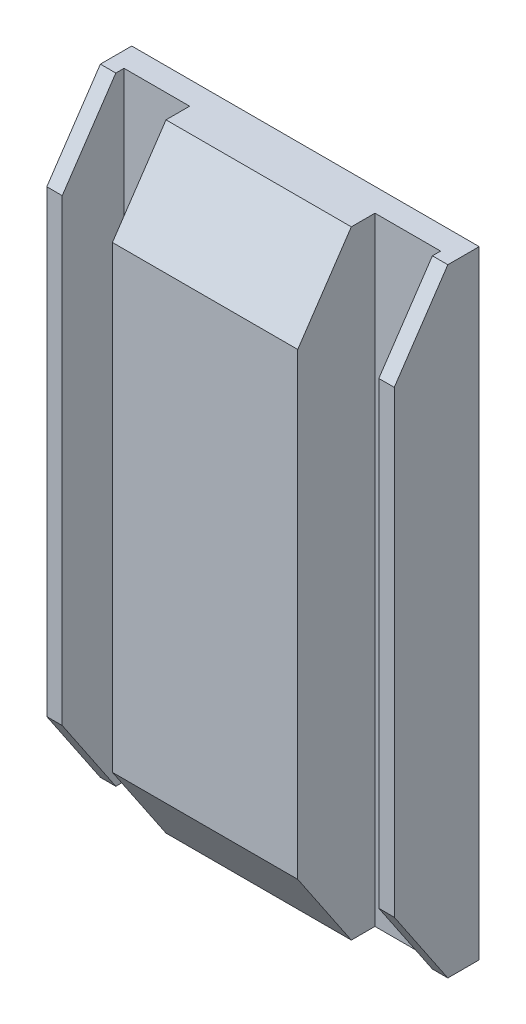
ISO-10303-21;
HEADER;
FILE_DESCRIPTION(('STEP AP214'),'2;1');
FILE_NAME('part.step','',(''),(''),'','','');
FILE_SCHEMA(('AUTOMOTIVE_DESIGN { 1 0 10303 214 1 1 1 1 }'));
ENDSEC;
DATA;
#1=APPLICATION_CONTEXT('core data for automotive mechanical design processes');
#2=APPLICATION_PROTOCOL_DEFINITION('international standard','automotive_design',2000,#1);
#3=PRODUCT_CONTEXT('',#1,'mechanical');
#4=PRODUCT('Part','Part','',(#3));
#5=PRODUCT_RELATED_PRODUCT_CATEGORY('part','',(#4));
#6=PRODUCT_DEFINITION_FORMATION('','',#4);
#7=PRODUCT_DEFINITION_CONTEXT('part definition',#1,'design');
#8=PRODUCT_DEFINITION('design','',#6,#7);
#9=PRODUCT_DEFINITION_SHAPE('','',#8);
#10=(LENGTH_UNIT() NAMED_UNIT(*) SI_UNIT(.MILLI.,.METRE.));
#11=(NAMED_UNIT(*) PLANE_ANGLE_UNIT() SI_UNIT($,.RADIAN.));
#12=(NAMED_UNIT(*) SI_UNIT($,.STERADIAN.) SOLID_ANGLE_UNIT());
#13=UNCERTAINTY_MEASURE_WITH_UNIT(LENGTH_MEASURE(1.E-05),#10,'distance_accuracy_value','');
#14=(GEOMETRIC_REPRESENTATION_CONTEXT(3) GLOBAL_UNCERTAINTY_ASSIGNED_CONTEXT((#13)) GLOBAL_UNIT_ASSIGNED_CONTEXT((#10,
#11,#12)) REPRESENTATION_CONTEXT('',''));
#15=CARTESIAN_POINT('',(0.,0.,0.));
#16=DIRECTION('',(0.,0.,1.));
#17=DIRECTION('',(1.,0.,0.));
#18=AXIS2_PLACEMENT_3D('',#15,#16,#17);
#19=CARTESIAN_POINT('',(154.389666666667,-114.892666666667,7.62));
#20=DIRECTION('',(0.,0.,-1.));
#21=DIRECTION('',(-1.,0.,0.));
#22=AXIS2_PLACEMENT_3D('',#19,#20,#21);
#23=PLANE('',#22);
#24=DIRECTION('',(0.,-1.,0.));
#25=VECTOR('',#24,1.);
#26=CARTESIAN_POINT('',(149.309666666667,-114.892666666667,7.62));
#27=LINE('',#26,#25);
#28=CARTESIAN_POINT('',(149.309666666667,88.3073333333333,7.62));
#29=VERTEX_POINT('',#28);
#30=CARTESIAN_POINT('',(149.309666666667,-114.892666666667,7.62));
#31=VERTEX_POINT('',#30);
#32=EDGE_CURVE('E216',#29,#31,#27,.T.);
#33=ORIENTED_EDGE('',*,*,#32,.F.);
#34=DIRECTION('',(-1.,0.,0.));
#35=VECTOR('',#34,1.);
#36=CARTESIAN_POINT('',(154.389666666667,88.3073333333333,7.62));
#37=LINE('',#36,#35);
#38=CARTESIAN_POINT('',(127.719666666667,88.3073333333333,7.62));
#39=VERTEX_POINT('',#38);
#40=EDGE_CURVE('E245',#29,#39,#37,.T.);
#41=ORIENTED_EDGE('',*,*,#40,.T.);
#42=DIRECTION('',(0.,1.,0.));
#43=VECTOR('',#42,1.);
#44=CARTESIAN_POINT('',(127.719666666667,-114.892666666667,7.62));
#45=LINE('',#44,#43);
#46=CARTESIAN_POINT('',(127.719666666667,-114.892666666667,7.62));
#47=VERTEX_POINT('',#46);
#48=EDGE_CURVE('E270',#47,#39,#45,.T.);
#49=ORIENTED_EDGE('',*,*,#48,.F.);
#50=DIRECTION('',(-1.,0.,0.));
#51=VECTOR('',#50,1.);
#52=CARTESIAN_POINT('',(154.389666666667,-114.892666666667,7.62));
#53=LINE('',#52,#51);
#54=EDGE_CURVE('E264',#31,#47,#53,.T.);
#55=ORIENTED_EDGE('',*,*,#54,.F.);
#56=EDGE_LOOP('',(#33,#41,#49,#55));
#57=FACE_BOUND('',#56,.T.);
#58=ADVANCED_FACE('F33',(#57),#23,.F.);
#59=CARTESIAN_POINT('',(40.0896666666667,-114.892666666667,7.62));
#60=DIRECTION('',(0.,0.,-1.));
#61=DIRECTION('',(-1.,0.,0.));
#62=AXIS2_PLACEMENT_3D('',#59,#60,#61);
#63=PLANE('',#62);
#64=DIRECTION('',(0.,1.,0.));
#65=VECTOR('',#64,1.);
#66=CARTESIAN_POINT('',(45.1696666666667,88.3073333333333,7.62));
#67=LINE('',#66,#65);
#68=CARTESIAN_POINT('',(45.1696666666667,-114.892666666667,7.62));
#69=VERTEX_POINT('',#68);
#70=CARTESIAN_POINT('',(45.1696666666667,88.3073333333333,7.62));
#71=VERTEX_POINT('',#70);
#72=EDGE_CURVE('E232',#69,#71,#67,.T.);
#73=ORIENTED_EDGE('',*,*,#72,.F.);
#74=DIRECTION('',(-1.,0.,0.));
#75=VECTOR('',#74,1.);
#76=CARTESIAN_POINT('',(40.0896666666667,-114.892666666667,7.62));
#77=LINE('',#76,#75);
#78=CARTESIAN_POINT('',(66.7596666666667,-114.892666666667,7.62));
#79=VERTEX_POINT('',#78);
#80=EDGE_CURVE('E248',#79,#69,#77,.T.);
#81=ORIENTED_EDGE('',*,*,#80,.F.);
#82=DIRECTION('',(0.,1.,0.));
#83=VECTOR('',#82,1.);
#84=CARTESIAN_POINT('',(66.7596666666667,-114.892666666667,7.62));
#85=LINE('',#84,#83);
#86=CARTESIAN_POINT('',(66.7596666666667,88.3073333333333,7.62));
#87=VERTEX_POINT('',#86);
#88=EDGE_CURVE('E258',#79,#87,#85,.T.);
#89=ORIENTED_EDGE('',*,*,#88,.T.);
#90=DIRECTION('',(-1.,0.,0.));
#91=VECTOR('',#90,1.);
#92=CARTESIAN_POINT('',(40.0896666666667,88.3073333333333,7.62));
#93=LINE('',#92,#91);
#94=EDGE_CURVE('E249',#87,#71,#93,.T.);
#95=ORIENTED_EDGE('',*,*,#94,.T.);
#96=EDGE_LOOP('',(#73,#81,#89,#95));
#97=FACE_BOUND('',#96,.T.);
#98=ADVANCED_FACE('F400',(#97),#63,.F.);
#99=CARTESIAN_POINT('',(40.0896666666667,88.3073333333333,33.02));
#100=DIRECTION('',(1.,0.,0.));
#101=DIRECTION('',(0.,1.,0.));
#102=AXIS2_PLACEMENT_3D('',#99,#100,#101);
#103=PLANE('',#102);
#104=DIRECTION('',(0.,0.,-1.));
#105=VECTOR('',#104,1.);
#106=CARTESIAN_POINT('',(40.0896666666668,-114.892666666667,33.02));
#107=LINE('',#106,#105);
#108=CARTESIAN_POINT('',(40.0896666666668,-114.892666666667,10.3199999999999));
#109=VERTEX_POINT('',#108);
#110=CARTESIAN_POINT('',(40.0896666666668,-114.892666666667,0.));
#111=VERTEX_POINT('',#110);
#112=EDGE_CURVE('E295',#109,#111,#107,.T.);
#113=ORIENTED_EDGE('',*,*,#112,.F.);
#114=DIRECTION('',(0.,0.829037572555041,0.559192903470748));
#115=VECTOR('',#114,1.);
#116=CARTESIAN_POINT('',(40.0896666666668,-88.7699424014722,27.94));
#117=LINE('',#116,#115);
#118=CARTESIAN_POINT('',(40.0896666666668,-88.7699424014722,27.94));
#119=VERTEX_POINT('',#118);
#120=EDGE_CURVE('E331',#109,#119,#117,.T.);
#121=ORIENTED_EDGE('',*,*,#120,.T.);
#122=DIRECTION('',(0.,-1.,0.));
#123=VECTOR('',#122,1.);
#124=CARTESIAN_POINT('',(40.0896666666667,88.3073333333333,27.94));
#125=LINE('',#124,#123);
#126=CARTESIAN_POINT('',(40.0896666666667,62.1846090681388,27.94));
#127=VERTEX_POINT('',#126);
#128=EDGE_CURVE('E233',#127,#119,#125,.T.);
#129=ORIENTED_EDGE('',*,*,#128,.F.);
#130=DIRECTION('',(0.,0.829037572555041,-0.559192903470748));
#131=VECTOR('',#130,1.);
#132=CARTESIAN_POINT('',(40.0896666666667,62.1846090681388,27.94));
#133=LINE('',#132,#131);
#134=CARTESIAN_POINT('',(40.0896666666667,88.3073333333333,10.3199999999999));
#135=VERTEX_POINT('',#134);
#136=EDGE_CURVE('E329',#127,#135,#133,.T.);
#137=ORIENTED_EDGE('',*,*,#136,.T.);
#138=DIRECTION('',(0.,0.,-1.));
#139=VECTOR('',#138,1.);
#140=CARTESIAN_POINT('',(40.0896666666667,88.3073333333333,33.02));
#141=LINE('',#140,#139);
#142=CARTESIAN_POINT('',(40.0896666666667,88.3073333333333,0.));
#143=VERTEX_POINT('',#142);
#144=EDGE_CURVE('E289',#135,#143,#141,.T.);
#145=ORIENTED_EDGE('',*,*,#144,.T.);
#146=DIRECTION('',(0.,-1.,0.));
#147=VECTOR('',#146,1.);
#148=CARTESIAN_POINT('',(40.0896666666667,88.3073333333333,0.));
#149=LINE('',#148,#147);
#150=EDGE_CURVE('E261',#143,#111,#149,.T.);
#151=ORIENTED_EDGE('',*,*,#150,.T.);
#152=EDGE_LOOP('',(#113,#121,#129,#137,#145,#151));
#153=FACE_BOUND('',#152,.T.);
#154=ADVANCED_FACE('F431',(#153),#103,.F.);
#155=CARTESIAN_POINT('',(40.0896666666668,-114.892666666667,33.02));
#156=DIRECTION('',(0.,1.,0.));
#157=DIRECTION('',(0.,0.,1.));
#158=AXIS2_PLACEMENT_3D('',#155,#156,#157);
#159=PLANE('',#158);
#160=DIRECTION('',(0.,0.,-1.));
#161=VECTOR('',#160,1.);
#162=CARTESIAN_POINT('',(45.1696666666668,-114.892666666667,27.94));
#163=LINE('',#162,#161);
#164=CARTESIAN_POINT('',(45.1696666666668,-114.892666666667,10.3199999999999));
#165=VERTEX_POINT('',#164);
#166=EDGE_CURVE('E243',#165,#69,#163,.T.);
#167=ORIENTED_EDGE('',*,*,#166,.F.);
#168=DIRECTION('',(-1.,0.,0.));
#169=VECTOR('',#168,1.);
#170=CARTESIAN_POINT('',(40.0896666666668,-114.892666666667,10.3199999999999));
#171=LINE('',#170,#169);
#172=EDGE_CURVE('E327',#165,#109,#171,.T.);
#173=ORIENTED_EDGE('',*,*,#172,.T.);
#174=ORIENTED_EDGE('',*,*,#112,.T.);
#175=DIRECTION('',(1.,0.,0.));
#176=VECTOR('',#175,1.);
#177=CARTESIAN_POINT('',(40.0896666666668,-114.892666666667,0.));
#178=LINE('',#177,#176);
#179=CARTESIAN_POINT('',(154.389666666667,-114.892666666667,0.));
#180=VERTEX_POINT('',#179);
#181=EDGE_CURVE('E280',#111,#180,#178,.T.);
#182=ORIENTED_EDGE('',*,*,#181,.T.);
#183=DIRECTION('',(0.,0.,-1.));
#184=VECTOR('',#183,1.);
#185=CARTESIAN_POINT('',(154.389666666667,-114.892666666667,33.02));
#186=LINE('',#185,#184);
#187=CARTESIAN_POINT('',(154.389666666667,-114.892666666667,10.3199999999999));
#188=VERTEX_POINT('',#187);
#189=EDGE_CURVE('E293',#188,#180,#186,.T.);
#190=ORIENTED_EDGE('',*,*,#189,.F.);
#191=DIRECTION('',(-1.,0.,0.));
#192=VECTOR('',#191,1.);
#193=CARTESIAN_POINT('',(149.309666666667,-114.892666666667,10.3199999999999));
#194=LINE('',#193,#192);
#195=CARTESIAN_POINT('',(149.309666666667,-114.892666666667,10.3199999999999));
#196=VERTEX_POINT('',#195);
#197=EDGE_CURVE('E325',#188,#196,#194,.T.);
#198=ORIENTED_EDGE('',*,*,#197,.T.);
#199=DIRECTION('',(0.,0.,-1.));
#200=VECTOR('',#199,1.);
#201=CARTESIAN_POINT('',(149.309666666667,-114.892666666667,27.94));
#202=LINE('',#201,#200);
#203=EDGE_CURVE('E226',#196,#31,#202,.T.);
#204=ORIENTED_EDGE('',*,*,#203,.T.);
#205=ORIENTED_EDGE('',*,*,#54,.T.);
#206=DIRECTION('',(0.,0.,1.));
#207=VECTOR('',#206,1.);
#208=CARTESIAN_POINT('',(127.719666666667,-114.892666666667,7.62));
#209=LINE('',#208,#207);
#210=CARTESIAN_POINT('',(127.719666666667,-114.892666666667,15.3999999999999));
#211=VERTEX_POINT('',#210);
#212=EDGE_CURVE('E266',#47,#211,#209,.T.);
#213=ORIENTED_EDGE('',*,*,#212,.T.);
#214=DIRECTION('',(-1.,0.,0.));
#215=VECTOR('',#214,1.);
#216=CARTESIAN_POINT('',(66.7596666666667,-114.892666666667,15.3999999999999));
#217=LINE('',#216,#215);
#218=CARTESIAN_POINT('',(66.7596666666667,-114.892666666667,15.3999999999999));
#219=VERTEX_POINT('',#218);
#220=EDGE_CURVE('E307',#211,#219,#217,.T.);
#221=ORIENTED_EDGE('',*,*,#220,.T.);
#222=DIRECTION('',(0.,0.,-1.));
#223=VECTOR('',#222,1.);
#224=CARTESIAN_POINT('',(66.7596666666667,-114.892666666667,7.62));
#225=LINE('',#224,#223);
#226=EDGE_CURVE('E246',#219,#79,#225,.T.);
#227=ORIENTED_EDGE('',*,*,#226,.T.);
#228=ORIENTED_EDGE('',*,*,#80,.T.);
#229=EDGE_LOOP('',(#167,#173,#174,#182,#190,#198,#204,#205,#213,#221,#227,#228));
#230=FACE_BOUND('',#229,.T.);
#231=ADVANCED_FACE('F371',(#230),#159,.F.);
#232=CARTESIAN_POINT('',(154.389666666667,88.3073333333333,33.02));
#233=DIRECTION('',(-1.,0.,0.));
#234=DIRECTION('',(0.,0.,1.));
#235=AXIS2_PLACEMENT_3D('',#232,#233,#234);
#236=PLANE('',#235);
#237=DIRECTION('',(0.,1.,0.));
#238=VECTOR('',#237,1.);
#239=CARTESIAN_POINT('',(154.389666666667,-114.892666666667,27.94));
#240=LINE('',#239,#238);
#241=CARTESIAN_POINT('',(154.389666666667,-88.7699424014722,27.94));
#242=VERTEX_POINT('',#241);
#243=CARTESIAN_POINT('',(154.389666666667,62.1846090681388,27.94));
#244=VERTEX_POINT('',#243);
#245=EDGE_CURVE('E220',#242,#244,#240,.T.);
#246=ORIENTED_EDGE('',*,*,#245,.F.);
#247=DIRECTION('',(0.,-0.829037572555041,-0.559192903470748));
#248=VECTOR('',#247,1.);
#249=CARTESIAN_POINT('',(154.389666666667,-88.7699424014722,27.94));
#250=LINE('',#249,#248);
#251=EDGE_CURVE('E341',#242,#188,#250,.T.);
#252=ORIENTED_EDGE('',*,*,#251,.T.);
#253=ORIENTED_EDGE('',*,*,#189,.T.);
#254=DIRECTION('',(0.,1.,0.));
#255=VECTOR('',#254,1.);
#256=CARTESIAN_POINT('',(154.389666666667,88.3073333333333,0.));
#257=LINE('',#256,#255);
#258=CARTESIAN_POINT('',(154.389666666667,88.3073333333333,0.));
#259=VERTEX_POINT('',#258);
#260=EDGE_CURVE('E283',#180,#259,#257,.T.);
#261=ORIENTED_EDGE('',*,*,#260,.T.);
#262=DIRECTION('',(0.,0.,-1.));
#263=VECTOR('',#262,1.);
#264=CARTESIAN_POINT('',(154.389666666667,88.3073333333333,33.02));
#265=LINE('',#264,#263);
#266=CARTESIAN_POINT('',(154.389666666667,88.3073333333333,10.3199999999999));
#267=VERTEX_POINT('',#266);
#268=EDGE_CURVE('E291',#267,#259,#265,.T.);
#269=ORIENTED_EDGE('',*,*,#268,.F.);
#270=DIRECTION('',(0.,-0.829037572555041,0.559192903470748));
#271=VECTOR('',#270,1.);
#272=CARTESIAN_POINT('',(154.389666666667,62.1846090681388,27.94));
#273=LINE('',#272,#271);
#274=EDGE_CURVE('E339',#267,#244,#273,.T.);
#275=ORIENTED_EDGE('',*,*,#274,.T.);
#276=EDGE_LOOP('',(#246,#252,#253,#261,#269,#275));
#277=FACE_BOUND('',#276,.T.);
#278=ADVANCED_FACE('F355',(#277),#236,.F.);
#279=CARTESIAN_POINT('',(40.0896666666667,88.3073333333333,33.02));
#280=DIRECTION('',(0.,-1.,0.));
#281=DIRECTION('',(0.,0.,-1.));
#282=AXIS2_PLACEMENT_3D('',#279,#280,#281);
#283=PLANE('',#282);
#284=ORIENTED_EDGE('',*,*,#144,.F.);
#285=DIRECTION('',(1.,0.,0.));
#286=VECTOR('',#285,1.);
#287=CARTESIAN_POINT('',(45.1696666666667,88.3073333333333,10.3199999999999));
#288=LINE('',#287,#286);
#289=CARTESIAN_POINT('',(45.1696666666667,88.3073333333333,10.3199999999999));
#290=VERTEX_POINT('',#289);
#291=EDGE_CURVE('E11',#135,#290,#288,.T.);
#292=ORIENTED_EDGE('',*,*,#291,.T.);
#293=DIRECTION('',(0.,0.,-1.));
#294=VECTOR('',#293,1.);
#295=CARTESIAN_POINT('',(45.1696666666667,88.3073333333333,27.94));
#296=LINE('',#295,#294);
#297=EDGE_CURVE('E239',#290,#71,#296,.T.);
#298=ORIENTED_EDGE('',*,*,#297,.T.);
#299=ORIENTED_EDGE('',*,*,#94,.F.);
#300=DIRECTION('',(0.,0.,-1.));
#301=VECTOR('',#300,1.);
#302=CARTESIAN_POINT('',(66.7596666666667,88.3073333333333,7.62));
#303=LINE('',#302,#301);
#304=CARTESIAN_POINT('',(66.7596666666667,88.3073333333333,15.3999999999999));
#305=VERTEX_POINT('',#304);
#306=EDGE_CURVE('E253',#305,#87,#303,.T.);
#307=ORIENTED_EDGE('',*,*,#306,.F.);
#308=DIRECTION('',(1.,0.,0.));
#309=VECTOR('',#308,1.);
#310=CARTESIAN_POINT('',(127.719666666667,88.3073333333333,15.3999999999999));
#311=LINE('',#310,#309);
#312=CARTESIAN_POINT('',(127.719666666667,88.3073333333333,15.3999999999999));
#313=VERTEX_POINT('',#312);
#314=EDGE_CURVE('E313',#305,#313,#311,.T.);
#315=ORIENTED_EDGE('',*,*,#314,.T.);
#316=DIRECTION('',(0.,0.,1.));
#317=VECTOR('',#316,1.);
#318=CARTESIAN_POINT('',(127.719666666667,88.3073333333333,7.62));
#319=LINE('',#318,#317);
#320=EDGE_CURVE('E267',#39,#313,#319,.T.);
#321=ORIENTED_EDGE('',*,*,#320,.F.);
#322=ORIENTED_EDGE('',*,*,#40,.F.);
#323=DIRECTION('',(0.,0.,-1.));
#324=VECTOR('',#323,1.);
#325=CARTESIAN_POINT('',(149.309666666667,88.3073333333333,27.94));
#326=LINE('',#325,#324);
#327=CARTESIAN_POINT('',(149.309666666667,88.3073333333333,10.3199999999999));
#328=VERTEX_POINT('',#327);
#329=EDGE_CURVE('E230',#328,#29,#326,.T.);
#330=ORIENTED_EDGE('',*,*,#329,.F.);
#331=DIRECTION('',(1.,0.,0.));
#332=VECTOR('',#331,1.);
#333=CARTESIAN_POINT('',(154.389666666667,88.3073333333333,10.3199999999999));
#334=LINE('',#333,#332);
#335=EDGE_CURVE('E41',#328,#267,#334,.T.);
#336=ORIENTED_EDGE('',*,*,#335,.T.);
#337=ORIENTED_EDGE('',*,*,#268,.T.);
#338=DIRECTION('',(-1.,0.,0.));
#339=VECTOR('',#338,1.);
#340=CARTESIAN_POINT('',(40.0896666666667,88.3073333333333,0.));
#341=LINE('',#340,#339);
#342=EDGE_CURVE('E286',#259,#143,#341,.T.);
#343=ORIENTED_EDGE('',*,*,#342,.T.);
#344=EDGE_LOOP('',(#284,#292,#298,#299,#307,#315,#321,#322,#330,#336,#337,#343));
#345=FACE_BOUND('',#344,.T.);
#346=ADVANCED_FACE('F349',(#345),#283,.F.);
#347=CARTESIAN_POINT('',(0.,0.,33.02));
#348=DIRECTION('',(0.,0.,1.));
#349=DIRECTION('',(1.,0.,0.));
#350=AXIS2_PLACEMENT_3D('',#347,#348,#349);
#351=PLANE('',#350);
#352=DIRECTION('',(0.,1.,0.));
#353=VECTOR('',#352,1.);
#354=CARTESIAN_POINT('',(66.7596666666667,-114.892666666667,33.02));
#355=LINE('',#354,#353);
#356=CARTESIAN_POINT('',(66.7596666666667,-88.7699424014722,33.02));
#357=VERTEX_POINT('',#356);
#358=CARTESIAN_POINT('',(66.7596666666667,62.1846090681388,33.02));
#359=VERTEX_POINT('',#358);
#360=EDGE_CURVE('E252',#357,#359,#355,.T.);
#361=ORIENTED_EDGE('',*,*,#360,.F.);
#362=DIRECTION('',(1.,0.,0.));
#363=VECTOR('',#362,1.);
#364=CARTESIAN_POINT('',(127.719666666667,-88.7699424014722,33.02));
#365=LINE('',#364,#363);
#366=CARTESIAN_POINT('',(127.719666666667,-88.7699424014722,33.02));
#367=VERTEX_POINT('',#366);
#368=EDGE_CURVE('E300',#357,#367,#365,.T.);
#369=ORIENTED_EDGE('',*,*,#368,.T.);
#370=DIRECTION('',(0.,1.,0.));
#371=VECTOR('',#370,1.);
#372=CARTESIAN_POINT('',(127.719666666667,-114.892666666667,33.02));
#373=LINE('',#372,#371);
#374=CARTESIAN_POINT('',(127.719666666667,62.1846090681388,33.02));
#375=VERTEX_POINT('',#374);
#376=EDGE_CURVE('E255',#367,#375,#373,.T.);
#377=ORIENTED_EDGE('',*,*,#376,.T.);
#378=DIRECTION('',(-1.,0.,0.));
#379=VECTOR('',#378,1.);
#380=CARTESIAN_POINT('',(66.7596666666667,62.1846090681388,33.02));
#381=LINE('',#380,#379);
#382=EDGE_CURVE('E297',#375,#359,#381,.T.);
#383=ORIENTED_EDGE('',*,*,#382,.T.);
#384=EDGE_LOOP('',(#361,#369,#377,#383));
#385=FACE_BOUND('',#384,.T.);
#386=ADVANCED_FACE('F415',(#385),#351,.T.);
#387=CARTESIAN_POINT('',(0.,0.,0.));
#388=DIRECTION('',(0.,0.,1.));
#389=DIRECTION('',(1.,0.,0.));
#390=AXIS2_PLACEMENT_3D('',#387,#388,#389);
#391=PLANE('',#390);
#392=DIRECTION('',(-1.,0.,0.));
#393=VECTOR('',#392,1.);
#394=CARTESIAN_POINT('',(135.339666666667,-13.2926666666667,0.));
#395=LINE('',#394,#393);
#396=CARTESIAN_POINT('',(135.339666666667,-13.2926666666667,0.));
#397=VERTEX_POINT('',#396);
#398=CARTESIAN_POINT('',(59.1396666666667,-13.2926666666667,0.));
#399=VERTEX_POINT('',#398);
#400=EDGE_CURVE('E210',#397,#399,#395,.T.);
#401=ORIENTED_EDGE('',*,*,#400,.F.);
#402=DIRECTION('',(0.,-1.,0.));
#403=VECTOR('',#402,1.);
#404=CARTESIAN_POINT('',(135.339666666667,62.9073333333333,0.));
#405=LINE('',#404,#403);
#406=CARTESIAN_POINT('',(135.339666666667,62.9073333333333,0.));
#407=VERTEX_POINT('',#406);
#408=EDGE_CURVE('E48',#407,#397,#405,.T.);
#409=ORIENTED_EDGE('',*,*,#408,.F.);
#410=DIRECTION('',(1.,0.,0.));
#411=VECTOR('',#410,1.);
#412=CARTESIAN_POINT('',(135.339666666667,62.9073333333333,0.));
#413=LINE('',#412,#411);
#414=CARTESIAN_POINT('',(59.1396666666667,62.9073333333333,0.));
#415=VERTEX_POINT('',#414);
#416=EDGE_CURVE('E201',#415,#407,#413,.T.);
#417=ORIENTED_EDGE('',*,*,#416,.F.);
#418=DIRECTION('',(0.,1.,0.));
#419=VECTOR('',#418,1.);
#420=CARTESIAN_POINT('',(59.1396666666667,62.9073333333333,0.));
#421=LINE('',#420,#419);
#422=EDGE_CURVE('E204',#399,#415,#421,.T.);
#423=ORIENTED_EDGE('',*,*,#422,.F.);
#424=EDGE_LOOP('',(#401,#409,#417,#423));
#425=FACE_BOUND('',#424,.T.);
#426=ORIENTED_EDGE('',*,*,#150,.F.);
#427=ORIENTED_EDGE('',*,*,#342,.F.);
#428=ORIENTED_EDGE('',*,*,#260,.F.);
#429=ORIENTED_EDGE('',*,*,#181,.F.);
#430=EDGE_LOOP('',(#426,#427,#428,#429));
#431=FACE_BOUND('',#430,.T.);
#432=ADVANCED_FACE('F376',(#425,#431),#391,.F.);
#433=CARTESIAN_POINT('',(127.719666666667,-114.892666666667,7.62));
#434=DIRECTION('',(-1.,0.,0.));
#435=DIRECTION('',(0.,0.,1.));
#436=AXIS2_PLACEMENT_3D('',#433,#434,#435);
#437=PLANE('',#436);
#438=ORIENTED_EDGE('',*,*,#376,.F.);
#439=DIRECTION('',(0.,-0.829037572555041,-0.559192903470748));
#440=VECTOR('',#439,1.);
#441=CARTESIAN_POINT('',(127.719666666667,-88.7699424014722,33.02));
#442=LINE('',#441,#440);
#443=EDGE_CURVE('E305',#367,#211,#442,.T.);
#444=ORIENTED_EDGE('',*,*,#443,.T.);
#445=ORIENTED_EDGE('',*,*,#212,.F.);
#446=ORIENTED_EDGE('',*,*,#48,.T.);
#447=ORIENTED_EDGE('',*,*,#320,.T.);
#448=DIRECTION('',(0.,-0.829037572555041,0.559192903470748));
#449=VECTOR('',#448,1.);
#450=CARTESIAN_POINT('',(127.719666666667,62.1846090681388,33.02));
#451=LINE('',#450,#449);
#452=EDGE_CURVE('E303',#313,#375,#451,.T.);
#453=ORIENTED_EDGE('',*,*,#452,.T.);
#454=EDGE_LOOP('',(#438,#444,#445,#446,#447,#453));
#455=FACE_BOUND('',#454,.T.);
#456=ADVANCED_FACE('F412',(#455),#437,.F.);
#457=CARTESIAN_POINT('',(66.7596666666667,-114.892666666667,7.62));
#458=DIRECTION('',(1.,0.,0.));
#459=DIRECTION('',(0.,0.,-1.));
#460=AXIS2_PLACEMENT_3D('',#457,#458,#459);
#461=PLANE('',#460);
#462=ORIENTED_EDGE('',*,*,#226,.F.);
#463=DIRECTION('',(0.,0.829037572555041,0.559192903470748));
#464=VECTOR('',#463,1.);
#465=CARTESIAN_POINT('',(66.7596666666667,-88.7699424014722,33.02));
#466=LINE('',#465,#464);
#467=EDGE_CURVE('E311',#219,#357,#466,.T.);
#468=ORIENTED_EDGE('',*,*,#467,.T.);
#469=ORIENTED_EDGE('',*,*,#360,.T.);
#470=DIRECTION('',(0.,0.829037572555041,-0.559192903470748));
#471=VECTOR('',#470,1.);
#472=CARTESIAN_POINT('',(66.7596666666667,62.1846090681388,33.02));
#473=LINE('',#472,#471);
#474=EDGE_CURVE('E309',#359,#305,#473,.T.);
#475=ORIENTED_EDGE('',*,*,#474,.T.);
#476=ORIENTED_EDGE('',*,*,#306,.T.);
#477=ORIENTED_EDGE('',*,*,#88,.F.);
#478=EDGE_LOOP('',(#462,#468,#469,#475,#476,#477));
#479=FACE_BOUND('',#478,.T.);
#480=ADVANCED_FACE('F451',(#479),#461,.F.);
#481=CARTESIAN_POINT('',(0.,-88.7699424014722,33.02));
#482=DIRECTION('',(0.,-0.559192903470748,0.829037572555041));
#483=DIRECTION('',(-1.,0.,0.));
#484=AXIS2_PLACEMENT_3D('',#481,#482,#483);
#485=PLANE('',#484);
#486=ORIENTED_EDGE('',*,*,#467,.F.);
#487=ORIENTED_EDGE('',*,*,#220,.F.);
#488=ORIENTED_EDGE('',*,*,#443,.F.);
#489=ORIENTED_EDGE('',*,*,#368,.F.);
#490=EDGE_LOOP('',(#486,#487,#488,#489));
#491=FACE_BOUND('',#490,.T.);
#492=ADVANCED_FACE('F419',(#491),#485,.T.);
#493=CARTESIAN_POINT('',(0.,62.1846090681388,33.02));
#494=DIRECTION('',(0.,0.559192903470748,0.829037572555041));
#495=DIRECTION('',(1.,0.,0.));
#496=AXIS2_PLACEMENT_3D('',#493,#494,#495);
#497=PLANE('',#496);
#498=ORIENTED_EDGE('',*,*,#452,.F.);
#499=ORIENTED_EDGE('',*,*,#314,.F.);
#500=ORIENTED_EDGE('',*,*,#474,.F.);
#501=ORIENTED_EDGE('',*,*,#382,.F.);
#502=EDGE_LOOP('',(#498,#499,#500,#501));
#503=FACE_BOUND('',#502,.T.);
#504=ADVANCED_FACE('F408',(#503),#497,.T.);
#505=CARTESIAN_POINT('',(45.1696666666667,88.3073333333333,27.94));
#506=DIRECTION('',(-1.,0.,0.));
#507=DIRECTION('',(0.,-1.,0.));
#508=AXIS2_PLACEMENT_3D('',#505,#506,#507);
#509=PLANE('',#508);
#510=DIRECTION('',(0.,1.,0.));
#511=VECTOR('',#510,1.);
#512=CARTESIAN_POINT('',(45.1696666666667,88.3073333333333,27.94));
#513=LINE('',#512,#511);
#514=CARTESIAN_POINT('',(45.1696666666668,-88.7699424014722,27.94));
#515=VERTEX_POINT('',#514);
#516=CARTESIAN_POINT('',(45.1696666666667,62.1846090681388,27.94));
#517=VERTEX_POINT('',#516);
#518=EDGE_CURVE('E236',#515,#517,#513,.T.);
#519=ORIENTED_EDGE('',*,*,#518,.F.);
#520=DIRECTION('',(0.,-0.829037572555041,-0.559192903470748));
#521=VECTOR('',#520,1.);
#522=CARTESIAN_POINT('',(45.1696666666668,-88.7699424014722,27.94));
#523=LINE('',#522,#521);
#524=EDGE_CURVE('E323',#515,#165,#523,.T.);
#525=ORIENTED_EDGE('',*,*,#524,.T.);
#526=ORIENTED_EDGE('',*,*,#166,.T.);
#527=ORIENTED_EDGE('',*,*,#72,.T.);
#528=ORIENTED_EDGE('',*,*,#297,.F.);
#529=DIRECTION('',(0.,-0.829037572555041,0.559192903470748));
#530=VECTOR('',#529,1.);
#531=CARTESIAN_POINT('',(45.1696666666667,62.1846090681388,27.94));
#532=LINE('',#531,#530);
#533=EDGE_CURVE('E321',#290,#517,#532,.T.);
#534=ORIENTED_EDGE('',*,*,#533,.T.);
#535=EDGE_LOOP('',(#519,#525,#526,#527,#528,#534));
#536=FACE_BOUND('',#535,.T.);
#537=ADVANCED_FACE('F386',(#536),#509,.F.);
#538=CARTESIAN_POINT('',(0.,0.,27.94));
#539=DIRECTION('',(0.,0.,1.));
#540=DIRECTION('',(1.,0.,0.));
#541=AXIS2_PLACEMENT_3D('',#538,#539,#540);
#542=PLANE('',#541);
#543=ORIENTED_EDGE('',*,*,#128,.T.);
#544=DIRECTION('',(1.,0.,0.));
#545=VECTOR('',#544,1.);
#546=CARTESIAN_POINT('',(45.1696666666668,-88.7699424014722,27.94));
#547=LINE('',#546,#545);
#548=EDGE_CURVE('E318',#119,#515,#547,.T.);
#549=ORIENTED_EDGE('',*,*,#548,.T.);
#550=ORIENTED_EDGE('',*,*,#518,.T.);
#551=DIRECTION('',(-1.,0.,0.));
#552=VECTOR('',#551,1.);
#553=CARTESIAN_POINT('',(40.0896666666667,62.1846090681388,27.94));
#554=LINE('',#553,#552);
#555=EDGE_CURVE('E315',#517,#127,#554,.T.);
#556=ORIENTED_EDGE('',*,*,#555,.T.);
#557=EDGE_LOOP('',(#543,#549,#550,#556));
#558=FACE_BOUND('',#557,.T.);
#559=ADVANCED_FACE('F388',(#558),#542,.T.);
#560=CARTESIAN_POINT('',(149.309666666667,-114.892666666667,27.94));
#561=DIRECTION('',(1.,0.,0.));
#562=DIRECTION('',(0.,0.,-1.));
#563=AXIS2_PLACEMENT_3D('',#560,#561,#562);
#564=PLANE('',#563);
#565=ORIENTED_EDGE('',*,*,#203,.F.);
#566=DIRECTION('',(0.,0.829037572555041,0.559192903470748));
#567=VECTOR('',#566,1.);
#568=CARTESIAN_POINT('',(149.309666666667,-88.7699424014722,27.94));
#569=LINE('',#568,#567);
#570=CARTESIAN_POINT('',(149.309666666667,-88.7699424014722,27.94));
#571=VERTEX_POINT('',#570);
#572=EDGE_CURVE('E344',#196,#571,#569,.T.);
#573=ORIENTED_EDGE('',*,*,#572,.T.);
#574=DIRECTION('',(0.,-1.,0.));
#575=VECTOR('',#574,1.);
#576=CARTESIAN_POINT('',(149.309666666667,-114.892666666667,27.94));
#577=LINE('',#576,#575);
#578=CARTESIAN_POINT('',(149.309666666667,62.1846090681388,27.94));
#579=VERTEX_POINT('',#578);
#580=EDGE_CURVE('E223',#579,#571,#577,.T.);
#581=ORIENTED_EDGE('',*,*,#580,.F.);
#582=DIRECTION('',(0.,0.829037572555041,-0.559192903470748));
#583=VECTOR('',#582,1.);
#584=CARTESIAN_POINT('',(149.309666666667,62.1846090681388,27.94));
#585=LINE('',#584,#583);
#586=EDGE_CURVE('E56',#579,#328,#585,.T.);
#587=ORIENTED_EDGE('',*,*,#586,.T.);
#588=ORIENTED_EDGE('',*,*,#329,.T.);
#589=ORIENTED_EDGE('',*,*,#32,.T.);
#590=EDGE_LOOP('',(#565,#573,#581,#587,#588,#589));
#591=FACE_BOUND('',#590,.T.);
#592=ADVANCED_FACE('F363',(#591),#564,.F.);
#593=CARTESIAN_POINT('',(0.,0.,27.94));
#594=DIRECTION('',(0.,0.,1.));
#595=DIRECTION('',(1.,0.,0.));
#596=AXIS2_PLACEMENT_3D('',#593,#594,#595);
#597=PLANE('',#596);
#598=ORIENTED_EDGE('',*,*,#580,.T.);
#599=DIRECTION('',(1.,0.,0.));
#600=VECTOR('',#599,1.);
#601=CARTESIAN_POINT('',(154.389666666667,-88.7699424014722,27.94));
#602=LINE('',#601,#600);
#603=EDGE_CURVE('E336',#571,#242,#602,.T.);
#604=ORIENTED_EDGE('',*,*,#603,.T.);
#605=ORIENTED_EDGE('',*,*,#245,.T.);
#606=DIRECTION('',(-1.,0.,0.));
#607=VECTOR('',#606,1.);
#608=CARTESIAN_POINT('',(149.309666666667,62.1846090681388,27.94));
#609=LINE('',#608,#607);
#610=EDGE_CURVE('E333',#244,#579,#609,.T.);
#611=ORIENTED_EDGE('',*,*,#610,.T.);
#612=EDGE_LOOP('',(#598,#604,#605,#611));
#613=FACE_BOUND('',#612,.T.);
#614=ADVANCED_FACE('F360',(#613),#597,.T.);
#615=CARTESIAN_POINT('',(0.,-88.7699424014722,27.94));
#616=DIRECTION('',(0.,-0.559192903470748,0.829037572555041));
#617=DIRECTION('',(-1.,0.,0.));
#618=AXIS2_PLACEMENT_3D('',#615,#616,#617);
#619=PLANE('',#618);
#620=ORIENTED_EDGE('',*,*,#120,.F.);
#621=ORIENTED_EDGE('',*,*,#172,.F.);
#622=ORIENTED_EDGE('',*,*,#524,.F.);
#623=ORIENTED_EDGE('',*,*,#548,.F.);
#624=EDGE_LOOP('',(#620,#621,#622,#623));
#625=FACE_BOUND('',#624,.T.);
#626=ADVANCED_FACE('F393',(#625),#619,.T.);
#627=CARTESIAN_POINT('',(0.,-88.7699424014722,27.94));
#628=DIRECTION('',(0.,-0.559192903470748,0.829037572555041));
#629=DIRECTION('',(-1.,0.,0.));
#630=AXIS2_PLACEMENT_3D('',#627,#628,#629);
#631=PLANE('',#630);
#632=ORIENTED_EDGE('',*,*,#572,.F.);
#633=ORIENTED_EDGE('',*,*,#197,.F.);
#634=ORIENTED_EDGE('',*,*,#251,.F.);
#635=ORIENTED_EDGE('',*,*,#603,.F.);
#636=EDGE_LOOP('',(#632,#633,#634,#635));
#637=FACE_BOUND('',#636,.T.);
#638=ADVANCED_FACE('F367',(#637),#631,.T.);
#639=CARTESIAN_POINT('',(0.,62.1846090681388,27.94));
#640=DIRECTION('',(0.,0.559192903470748,0.829037572555041));
#641=DIRECTION('',(1.,0.,0.));
#642=AXIS2_PLACEMENT_3D('',#639,#640,#641);
#643=PLANE('',#642);
#644=ORIENTED_EDGE('',*,*,#533,.F.);
#645=ORIENTED_EDGE('',*,*,#291,.F.);
#646=ORIENTED_EDGE('',*,*,#136,.F.);
#647=ORIENTED_EDGE('',*,*,#555,.F.);
#648=EDGE_LOOP('',(#644,#645,#646,#647));
#649=FACE_BOUND('',#648,.T.);
#650=ADVANCED_FACE('F382',(#649),#643,.T.);
#651=CARTESIAN_POINT('',(0.,62.1846090681388,27.94));
#652=DIRECTION('',(0.,0.559192903470748,0.829037572555041));
#653=DIRECTION('',(1.,0.,0.));
#654=AXIS2_PLACEMENT_3D('',#651,#652,#653);
#655=PLANE('',#654);
#656=ORIENTED_EDGE('',*,*,#274,.F.);
#657=ORIENTED_EDGE('',*,*,#335,.F.);
#658=ORIENTED_EDGE('',*,*,#586,.F.);
#659=ORIENTED_EDGE('',*,*,#610,.F.);
#660=EDGE_LOOP('',(#656,#657,#658,#659));
#661=FACE_BOUND('',#660,.T.);
#662=ADVANCED_FACE('F35',(#661),#655,.T.);
#663=CARTESIAN_POINT('',(135.339666666667,62.9073333333333,2.54));
#664=DIRECTION('',(1.,0.,0.));
#665=DIRECTION('',(0.,0.,-1.));
#666=AXIS2_PLACEMENT_3D('',#663,#664,#665);
#667=PLANE('',#666);
#668=ORIENTED_EDGE('',*,*,#408,.T.);
#669=DIRECTION('',(0.,0.,-1.));
#670=VECTOR('',#669,1.);
#671=CARTESIAN_POINT('',(135.339666666667,-13.2926666666667,2.54));
#672=LINE('',#671,#670);
#673=CARTESIAN_POINT('',(135.339666666667,-13.2926666666667,2.54));
#674=VERTEX_POINT('',#673);
#675=EDGE_CURVE('E179',#674,#397,#672,.T.);
#676=ORIENTED_EDGE('',*,*,#675,.F.);
#677=DIRECTION('',(0.,-1.,0.));
#678=VECTOR('',#677,1.);
#679=CARTESIAN_POINT('',(135.339666666667,62.9073333333333,2.54));
#680=LINE('',#679,#678);
#681=CARTESIAN_POINT('',(135.339666666667,62.9073333333333,2.54));
#682=VERTEX_POINT('',#681);
#683=EDGE_CURVE('E183',#682,#674,#680,.T.);
#684=ORIENTED_EDGE('',*,*,#683,.F.);
#685=DIRECTION('',(0.,0.,-1.));
#686=VECTOR('',#685,1.);
#687=CARTESIAN_POINT('',(135.339666666667,62.9073333333333,2.54));
#688=LINE('',#687,#686);
#689=EDGE_CURVE('E214',#682,#407,#688,.T.);
#690=ORIENTED_EDGE('',*,*,#689,.T.);
#691=EDGE_LOOP('',(#668,#676,#684,#690));
#692=FACE_BOUND('',#691,.T.);
#693=ADVANCED_FACE('F181',(#692),#667,.F.);
#694=CARTESIAN_POINT('',(135.339666666667,62.9073333333333,2.54));
#695=DIRECTION('',(0.,1.,0.));
#696=DIRECTION('',(0.,0.,1.));
#697=AXIS2_PLACEMENT_3D('',#694,#695,#696);
#698=PLANE('',#697);
#699=ORIENTED_EDGE('',*,*,#416,.T.);
#700=ORIENTED_EDGE('',*,*,#689,.F.);
#701=DIRECTION('',(1.,0.,0.));
#702=VECTOR('',#701,1.);
#703=CARTESIAN_POINT('',(135.339666666667,62.9073333333333,2.54));
#704=LINE('',#703,#702);
#705=CARTESIAN_POINT('',(59.1396666666667,62.9073333333333,2.54));
#706=VERTEX_POINT('',#705);
#707=EDGE_CURVE('E189',#706,#682,#704,.T.);
#708=ORIENTED_EDGE('',*,*,#707,.F.);
#709=DIRECTION('',(0.,0.,-1.));
#710=VECTOR('',#709,1.);
#711=CARTESIAN_POINT('',(59.1396666666667,62.9073333333333,2.54));
#712=LINE('',#711,#710);
#713=EDGE_CURVE('E217',#706,#415,#712,.T.);
#714=ORIENTED_EDGE('',*,*,#713,.T.);
#715=EDGE_LOOP('',(#699,#700,#708,#714));
#716=FACE_BOUND('',#715,.T.);
#717=ADVANCED_FACE('F464',(#716),#698,.F.);
#718=CARTESIAN_POINT('',(59.1396666666667,62.9073333333333,2.54));
#719=DIRECTION('',(-1.,0.,0.));
#720=DIRECTION('',(0.,-1.,0.));
#721=AXIS2_PLACEMENT_3D('',#718,#719,#720);
#722=PLANE('',#721);
#723=ORIENTED_EDGE('',*,*,#422,.T.);
#724=ORIENTED_EDGE('',*,*,#713,.F.);
#725=DIRECTION('',(0.,1.,0.));
#726=VECTOR('',#725,1.);
#727=CARTESIAN_POINT('',(59.1396666666667,62.9073333333333,2.54));
#728=LINE('',#727,#726);
#729=CARTESIAN_POINT('',(59.1396666666667,-13.2926666666667,2.54));
#730=VERTEX_POINT('',#729);
#731=EDGE_CURVE('E197',#730,#706,#728,.T.);
#732=ORIENTED_EDGE('',*,*,#731,.F.);
#733=DIRECTION('',(0.,0.,-1.));
#734=VECTOR('',#733,1.);
#735=CARTESIAN_POINT('',(59.1396666666667,-13.2926666666667,2.54));
#736=LINE('',#735,#734);
#737=EDGE_CURVE('E188',#730,#399,#736,.T.);
#738=ORIENTED_EDGE('',*,*,#737,.T.);
#739=EDGE_LOOP('',(#723,#724,#732,#738));
#740=FACE_BOUND('',#739,.T.);
#741=ADVANCED_FACE('F469',(#740),#722,.F.);
#742=CARTESIAN_POINT('',(135.339666666667,-13.2926666666667,2.54));
#743=DIRECTION('',(0.,-1.,0.));
#744=DIRECTION('',(0.,0.,-1.));
#745=AXIS2_PLACEMENT_3D('',#742,#743,#744);
#746=PLANE('',#745);
#747=ORIENTED_EDGE('',*,*,#400,.T.);
#748=ORIENTED_EDGE('',*,*,#737,.F.);
#749=DIRECTION('',(-1.,0.,0.));
#750=VECTOR('',#749,1.);
#751=CARTESIAN_POINT('',(135.339666666667,-13.2926666666667,2.54));
#752=LINE('',#751,#750);
#753=EDGE_CURVE('E192',#674,#730,#752,.T.);
#754=ORIENTED_EDGE('',*,*,#753,.F.);
#755=ORIENTED_EDGE('',*,*,#675,.T.);
#756=EDGE_LOOP('',(#747,#748,#754,#755));
#757=FACE_BOUND('',#756,.T.);
#758=ADVANCED_FACE('F193',(#757),#746,.F.);
#759=CARTESIAN_POINT('',(0.,0.,2.54));
#760=DIRECTION('',(0.,0.,-1.));
#761=DIRECTION('',(-1.,0.,0.));
#762=AXIS2_PLACEMENT_3D('',#759,#760,#761);
#763=PLANE('',#762);
#764=ORIENTED_EDGE('',*,*,#683,.T.);
#765=ORIENTED_EDGE('',*,*,#753,.T.);
#766=ORIENTED_EDGE('',*,*,#731,.T.);
#767=ORIENTED_EDGE('',*,*,#707,.T.);
#768=EDGE_LOOP('',(#764,#765,#766,#767));
#769=FACE_BOUND('',#768,.T.);
#770=ADVANCED_FACE('F199',(#769),#763,.T.);
#771=CLOSED_SHELL('',(#58,#98,#154,#231,#278,#346,#386,#432,#456,#480,#492,#504,#537,#559,#592,
#614,#626,#638,#650,#662,#693,#717,#741,#758,#770));
#772=MANIFOLD_SOLID_BREP('B2',#771);
#773=ADVANCED_BREP_SHAPE_REPRESENTATION('',(#18,#772),#14);
#774=SHAPE_DEFINITION_REPRESENTATION(#9,#773);
ENDSEC;
END-ISO-10303-21;
